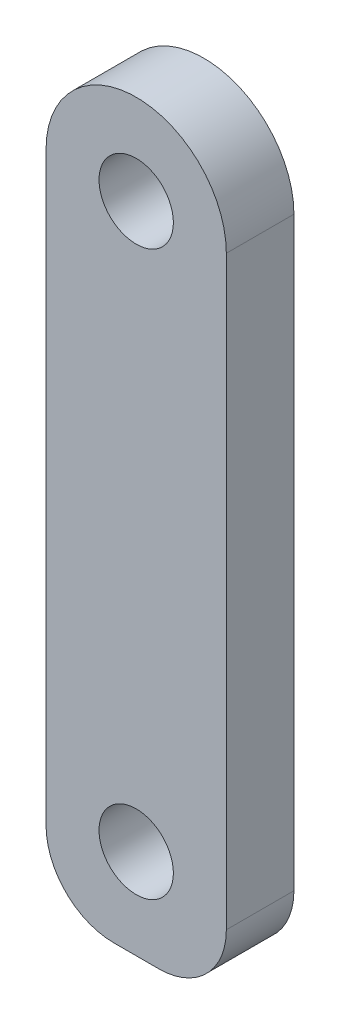
ISO-10303-21;
HEADER;
FILE_DESCRIPTION(('STEP AP214'),'2;1');
FILE_NAME('part.step','',(''),(''),'','','');
FILE_SCHEMA(('AUTOMOTIVE_DESIGN { 1 0 10303 214 1 1 1 1 }'));
ENDSEC;
DATA;
#1=APPLICATION_CONTEXT('core data for automotive mechanical design processes');
#2=APPLICATION_PROTOCOL_DEFINITION('international standard','automotive_design',2000,#1);
#3=PRODUCT_CONTEXT('',#1,'mechanical');
#4=PRODUCT('Part','Part','',(#3));
#5=PRODUCT_RELATED_PRODUCT_CATEGORY('part','',(#4));
#6=PRODUCT_DEFINITION_FORMATION('','',#4);
#7=PRODUCT_DEFINITION_CONTEXT('part definition',#1,'design');
#8=PRODUCT_DEFINITION('design','',#6,#7);
#9=PRODUCT_DEFINITION_SHAPE('','',#8);
#10=(LENGTH_UNIT() NAMED_UNIT(*) SI_UNIT(.MILLI.,.METRE.));
#11=(NAMED_UNIT(*) PLANE_ANGLE_UNIT() SI_UNIT($,.RADIAN.));
#12=(NAMED_UNIT(*) SI_UNIT($,.STERADIAN.) SOLID_ANGLE_UNIT());
#13=UNCERTAINTY_MEASURE_WITH_UNIT(LENGTH_MEASURE(1.E-05),#10,'distance_accuracy_value','');
#14=(GEOMETRIC_REPRESENTATION_CONTEXT(3) GLOBAL_UNCERTAINTY_ASSIGNED_CONTEXT((#13)) GLOBAL_UNIT_ASSIGNED_CONTEXT((#10,
#11,#12)) REPRESENTATION_CONTEXT('',''));
#15=CARTESIAN_POINT('',(0.,0.,0.));
#16=DIRECTION('',(0.,0.,1.));
#17=DIRECTION('',(1.,0.,0.));
#18=AXIS2_PLACEMENT_3D('',#15,#16,#17);
#19=CARTESIAN_POINT('',(0.,12.5,0.));
#20=DIRECTION('',(0.,0.,-1.));
#21=DIRECTION('',(-1.,0.,0.));
#22=AXIS2_PLACEMENT_3D('',#19,#20,#21);
#23=CYLINDRICAL_SURFACE('',#22,4.);
#24=DIRECTION('',(0.,0.,-1.));
#25=VECTOR('',#24,1.);
#26=CARTESIAN_POINT('',(4.,12.5,3.));
#27=LINE('',#26,#25);
#28=CARTESIAN_POINT('',(4.,12.5,0.));
#29=VERTEX_POINT('',#28);
#30=CARTESIAN_POINT('',(4.,12.5,3.));
#31=VERTEX_POINT('',#30);
#32=EDGE_CURVE('E100',#29,#31,#27,.F.);
#33=ORIENTED_EDGE('',*,*,#32,.F.);
#34=CARTESIAN_POINT('',(0.,12.5,0.));
#35=DIRECTION('',(0.,0.,1.));
#36=DIRECTION('',(1.,0.,0.));
#37=AXIS2_PLACEMENT_3D('',#34,#35,#36);
#38=CIRCLE('',#37,4.);
#39=CARTESIAN_POINT('',(-4.,12.5,0.));
#40=VERTEX_POINT('',#39);
#41=EDGE_CURVE('E43',#40,#29,#38,.F.);
#42=ORIENTED_EDGE('',*,*,#41,.F.);
#43=DIRECTION('',(0.,0.,-1.));
#44=VECTOR('',#43,1.);
#45=CARTESIAN_POINT('',(-4.,12.5,3.));
#46=LINE('',#45,#44);
#47=CARTESIAN_POINT('',(-4.,12.5,3.));
#48=VERTEX_POINT('',#47);
#49=EDGE_CURVE('E133',#48,#40,#46,.T.);
#50=ORIENTED_EDGE('',*,*,#49,.F.);
#51=CARTESIAN_POINT('',(0.,12.5,3.));
#52=DIRECTION('',(0.,0.,1.));
#53=DIRECTION('',(1.,0.,0.));
#54=AXIS2_PLACEMENT_3D('',#51,#52,#53);
#55=CIRCLE('',#54,4.);
#56=EDGE_CURVE('E11',#31,#48,#55,.T.);
#57=ORIENTED_EDGE('',*,*,#56,.F.);
#58=EDGE_LOOP('',(#33,#42,#50,#57));
#59=FACE_BOUND('',#58,.T.);
#60=ADVANCED_FACE('F35',(#59),#23,.T.);
#61=CARTESIAN_POINT('',(-1.,-13.5,3.));
#62=DIRECTION('',(0.,0.,1.));
#63=DIRECTION('',(1.,0.,0.));
#64=AXIS2_PLACEMENT_3D('',#61,#62,#63);
#65=PLANE('',#64);
#66=CARTESIAN_POINT('',(0.,12.5,3.));
#67=DIRECTION('',(0.,0.,1.));
#68=DIRECTION('',(1.,0.,0.));
#69=AXIS2_PLACEMENT_3D('',#66,#67,#68);
#70=CIRCLE('',#69,1.65);
#71=CARTESIAN_POINT('',(1.65,12.5,3.));
#72=VERTEX_POINT('',#71);
#73=EDGE_CURVE('E117',#72,#72,#70,.T.);
#74=ORIENTED_EDGE('',*,*,#73,.F.);
#75=EDGE_LOOP('',(#74));
#76=FACE_BOUND('',#75,.T.);
#77=DIRECTION('',(0.,1.,0.));
#78=VECTOR('',#77,1.);
#79=CARTESIAN_POINT('',(4.,-13.5,3.));
#80=LINE('',#79,#78);
#81=CARTESIAN_POINT('',(4.,-13.5,3.));
#82=VERTEX_POINT('',#81);
#83=EDGE_CURVE('E91',#82,#31,#80,.T.);
#84=ORIENTED_EDGE('',*,*,#83,.T.);
#85=ORIENTED_EDGE('',*,*,#56,.T.);
#86=DIRECTION('',(0.,-1.,0.));
#87=VECTOR('',#86,1.);
#88=CARTESIAN_POINT('',(-4.,-13.5,3.));
#89=LINE('',#88,#87);
#90=CARTESIAN_POINT('',(-4.,-13.5,3.));
#91=VERTEX_POINT('',#90);
#92=EDGE_CURVE('E83',#48,#91,#89,.T.);
#93=ORIENTED_EDGE('',*,*,#92,.T.);
#94=CARTESIAN_POINT('',(-1.,-13.5,3.));
#95=DIRECTION('',(0.,0.,1.));
#96=DIRECTION('',(1.,0.,0.));
#97=AXIS2_PLACEMENT_3D('',#94,#95,#96);
#98=CIRCLE('',#97,3.);
#99=CARTESIAN_POINT('',(-0.99999999999998,-16.5,3.));
#100=VERTEX_POINT('',#99);
#101=EDGE_CURVE('E88',#91,#100,#98,.T.);
#102=ORIENTED_EDGE('',*,*,#101,.T.);
#103=DIRECTION('',(1.,0.,0.));
#104=VECTOR('',#103,1.);
#105=CARTESIAN_POINT('',(-0.999999999999979,-16.5,3.));
#106=LINE('',#105,#104);
#107=CARTESIAN_POINT('',(0.999999999999979,-16.5,3.));
#108=VERTEX_POINT('',#107);
#109=EDGE_CURVE('E106',#100,#108,#106,.T.);
#110=ORIENTED_EDGE('',*,*,#109,.T.);
#111=CARTESIAN_POINT('',(1.,-13.5,3.));
#112=DIRECTION('',(0.,0.,1.));
#113=DIRECTION('',(-1.,0.,0.));
#114=AXIS2_PLACEMENT_3D('',#111,#112,#113);
#115=CIRCLE('',#114,3.);
#116=EDGE_CURVE('E108',#108,#82,#115,.T.);
#117=ORIENTED_EDGE('',*,*,#116,.T.);
#118=EDGE_LOOP('',(#84,#85,#93,#102,#110,#117));
#119=FACE_BOUND('',#118,.T.);
#120=CARTESIAN_POINT('',(0.,-12.5,3.));
#121=DIRECTION('',(0.,0.,1.));
#122=DIRECTION('',(1.,0.,0.));
#123=AXIS2_PLACEMENT_3D('',#120,#121,#122);
#124=CIRCLE('',#123,1.65);
#125=CARTESIAN_POINT('',(1.65,-12.5,3.));
#126=VERTEX_POINT('',#125);
#127=EDGE_CURVE('E154',#126,#126,#124,.T.);
#128=ORIENTED_EDGE('',*,*,#127,.F.);
#129=EDGE_LOOP('',(#128));
#130=FACE_BOUND('',#129,.T.);
#131=ADVANCED_FACE('F85',(#76,#119,#130),#65,.T.);
#132=CARTESIAN_POINT('',(-1.,-13.5,0.));
#133=DIRECTION('',(0.,0.,1.));
#134=DIRECTION('',(1.,0.,0.));
#135=AXIS2_PLACEMENT_3D('',#132,#133,#134);
#136=PLANE('',#135);
#137=DIRECTION('',(0.,-1.,0.));
#138=VECTOR('',#137,1.);
#139=CARTESIAN_POINT('',(-4.,-13.5,0.));
#140=LINE('',#139,#138);
#141=CARTESIAN_POINT('',(-4.,-13.5,0.));
#142=VERTEX_POINT('',#141);
#143=EDGE_CURVE('E97',#40,#142,#140,.T.);
#144=ORIENTED_EDGE('',*,*,#143,.F.);
#145=ORIENTED_EDGE('',*,*,#41,.T.);
#146=DIRECTION('',(0.,1.,0.));
#147=VECTOR('',#146,1.);
#148=CARTESIAN_POINT('',(4.,-13.5,0.));
#149=LINE('',#148,#147);
#150=CARTESIAN_POINT('',(4.,-13.5,0.));
#151=VERTEX_POINT('',#150);
#152=EDGE_CURVE('E114',#151,#29,#149,.T.);
#153=ORIENTED_EDGE('',*,*,#152,.F.);
#154=CARTESIAN_POINT('',(1.,-13.5,0.));
#155=DIRECTION('',(0.,0.,1.));
#156=DIRECTION('',(-1.,0.,0.));
#157=AXIS2_PLACEMENT_3D('',#154,#155,#156);
#158=CIRCLE('',#157,3.);
#159=CARTESIAN_POINT('',(0.999999999999979,-16.5,0.));
#160=VERTEX_POINT('',#159);
#161=EDGE_CURVE('E123',#160,#151,#158,.T.);
#162=ORIENTED_EDGE('',*,*,#161,.F.);
#163=DIRECTION('',(1.,0.,0.));
#164=VECTOR('',#163,1.);
#165=CARTESIAN_POINT('',(-0.999999999999979,-16.5,0.));
#166=LINE('',#165,#164);
#167=CARTESIAN_POINT('',(-0.99999999999998,-16.5,0.));
#168=VERTEX_POINT('',#167);
#169=EDGE_CURVE('E121',#168,#160,#166,.T.);
#170=ORIENTED_EDGE('',*,*,#169,.F.);
#171=CARTESIAN_POINT('',(-1.,-13.5,0.));
#172=DIRECTION('',(0.,0.,1.));
#173=DIRECTION('',(1.,0.,0.));
#174=AXIS2_PLACEMENT_3D('',#171,#172,#173);
#175=CIRCLE('',#174,3.);
#176=EDGE_CURVE('E119',#142,#168,#175,.T.);
#177=ORIENTED_EDGE('',*,*,#176,.F.);
#178=EDGE_LOOP('',(#144,#145,#153,#162,#170,#177));
#179=FACE_BOUND('',#178,.T.);
#180=CARTESIAN_POINT('',(0.,12.5,0.));
#181=DIRECTION('',(0.,0.,1.));
#182=DIRECTION('',(1.,0.,0.));
#183=AXIS2_PLACEMENT_3D('',#180,#181,#182);
#184=CIRCLE('',#183,1.65);
#185=CARTESIAN_POINT('',(1.65,12.5,0.));
#186=VERTEX_POINT('',#185);
#187=EDGE_CURVE('E151',#186,#186,#184,.T.);
#188=ORIENTED_EDGE('',*,*,#187,.T.);
#189=EDGE_LOOP('',(#188));
#190=FACE_BOUND('',#189,.T.);
#191=CARTESIAN_POINT('',(0.,-12.5,0.));
#192=DIRECTION('',(0.,0.,1.));
#193=DIRECTION('',(1.,0.,0.));
#194=AXIS2_PLACEMENT_3D('',#191,#192,#193);
#195=CIRCLE('',#194,1.65);
#196=CARTESIAN_POINT('',(1.65,-12.5,0.));
#197=VERTEX_POINT('',#196);
#198=EDGE_CURVE('E157',#197,#197,#195,.T.);
#199=ORIENTED_EDGE('',*,*,#198,.T.);
#200=EDGE_LOOP('',(#199));
#201=FACE_BOUND('',#200,.T.);
#202=ADVANCED_FACE('F136',(#179,#190,#201),#136,.F.);
#203=CARTESIAN_POINT('',(4.,-13.5,3.));
#204=DIRECTION('',(-1.,0.,0.));
#205=DIRECTION('',(0.,0.,1.));
#206=AXIS2_PLACEMENT_3D('',#203,#204,#205);
#207=PLANE('',#206);
#208=ORIENTED_EDGE('',*,*,#152,.T.);
#209=ORIENTED_EDGE('',*,*,#32,.T.);
#210=ORIENTED_EDGE('',*,*,#83,.F.);
#211=DIRECTION('',(0.,0.,-1.));
#212=VECTOR('',#211,1.);
#213=CARTESIAN_POINT('',(4.,-13.5,3.));
#214=LINE('',#213,#212);
#215=EDGE_CURVE('E113',#82,#151,#214,.T.);
#216=ORIENTED_EDGE('',*,*,#215,.T.);
#217=EDGE_LOOP('',(#208,#209,#210,#216));
#218=FACE_BOUND('',#217,.T.);
#219=ADVANCED_FACE('F141',(#218),#207,.F.);
#220=CARTESIAN_POINT('',(-4.,-13.5,3.));
#221=DIRECTION('',(1.,0.,0.));
#222=DIRECTION('',(0.,0.,-1.));
#223=AXIS2_PLACEMENT_3D('',#220,#221,#222);
#224=PLANE('',#223);
#225=ORIENTED_EDGE('',*,*,#92,.F.);
#226=ORIENTED_EDGE('',*,*,#49,.T.);
#227=ORIENTED_EDGE('',*,*,#143,.T.);
#228=DIRECTION('',(0.,0.,-1.));
#229=VECTOR('',#228,1.);
#230=CARTESIAN_POINT('',(-4.,-13.5,3.));
#231=LINE('',#230,#229);
#232=EDGE_CURVE('E94',#91,#142,#231,.T.);
#233=ORIENTED_EDGE('',*,*,#232,.F.);
#234=EDGE_LOOP('',(#225,#226,#227,#233));
#235=FACE_BOUND('',#234,.T.);
#236=ADVANCED_FACE('F95',(#235),#224,.F.);
#237=CARTESIAN_POINT('',(-1.,-13.5,3.));
#238=DIRECTION('',(0.,0.,-1.));
#239=DIRECTION('',(-1.,0.,0.));
#240=AXIS2_PLACEMENT_3D('',#237,#238,#239);
#241=CYLINDRICAL_SURFACE('',#240,3.);
#242=ORIENTED_EDGE('',*,*,#176,.T.);
#243=DIRECTION('',(0.,0.,-1.));
#244=VECTOR('',#243,1.);
#245=CARTESIAN_POINT('',(-0.99999999999998,-16.5,3.));
#246=LINE('',#245,#244);
#247=EDGE_CURVE('E101',#100,#168,#246,.T.);
#248=ORIENTED_EDGE('',*,*,#247,.F.);
#249=ORIENTED_EDGE('',*,*,#101,.F.);
#250=ORIENTED_EDGE('',*,*,#232,.T.);
#251=EDGE_LOOP('',(#242,#248,#249,#250));
#252=FACE_BOUND('',#251,.T.);
#253=ADVANCED_FACE('F103',(#252),#241,.T.);
#254=CARTESIAN_POINT('',(-0.999999999999979,-16.5,3.));
#255=DIRECTION('',(0.,1.,0.));
#256=DIRECTION('',(0.,0.,1.));
#257=AXIS2_PLACEMENT_3D('',#254,#255,#256);
#258=PLANE('',#257);
#259=ORIENTED_EDGE('',*,*,#169,.T.);
#260=DIRECTION('',(0.,0.,-1.));
#261=VECTOR('',#260,1.);
#262=CARTESIAN_POINT('',(0.999999999999979,-16.5,3.));
#263=LINE('',#262,#261);
#264=EDGE_CURVE('E127',#108,#160,#263,.T.);
#265=ORIENTED_EDGE('',*,*,#264,.F.);
#266=ORIENTED_EDGE('',*,*,#109,.F.);
#267=ORIENTED_EDGE('',*,*,#247,.T.);
#268=EDGE_LOOP('',(#259,#265,#266,#267));
#269=FACE_BOUND('',#268,.T.);
#270=ADVANCED_FACE('F149',(#269),#258,.F.);
#271=CARTESIAN_POINT('',(1.,-13.5,3.));
#272=DIRECTION('',(0.,0.,-1.));
#273=DIRECTION('',(-1.,0.,0.));
#274=AXIS2_PLACEMENT_3D('',#271,#272,#273);
#275=CYLINDRICAL_SURFACE('',#274,3.);
#276=ORIENTED_EDGE('',*,*,#161,.T.);
#277=ORIENTED_EDGE('',*,*,#215,.F.);
#278=ORIENTED_EDGE('',*,*,#116,.F.);
#279=ORIENTED_EDGE('',*,*,#264,.T.);
#280=EDGE_LOOP('',(#276,#277,#278,#279));
#281=FACE_BOUND('',#280,.T.);
#282=ADVANCED_FACE('F145',(#281),#275,.T.);
#283=CARTESIAN_POINT('',(0.,12.5,3.));
#284=DIRECTION('',(0.,0.,-1.));
#285=DIRECTION('',(-1.,0.,0.));
#286=AXIS2_PLACEMENT_3D('',#283,#284,#285);
#287=CYLINDRICAL_SURFACE('',#286,1.65);
#288=ORIENTED_EDGE('',*,*,#73,.T.);
#289=EDGE_LOOP('',(#288));
#290=FACE_BOUND('',#289,.T.);
#291=ORIENTED_EDGE('',*,*,#187,.F.);
#292=EDGE_LOOP('',(#291));
#293=FACE_BOUND('',#292,.T.);
#294=ADVANCED_FACE('F175',(#290,#293),#287,.F.);
#295=CARTESIAN_POINT('',(0.,-12.5,3.));
#296=DIRECTION('',(0.,0.,-1.));
#297=DIRECTION('',(-1.,0.,0.));
#298=AXIS2_PLACEMENT_3D('',#295,#296,#297);
#299=CYLINDRICAL_SURFACE('',#298,1.65);
#300=ORIENTED_EDGE('',*,*,#127,.T.);
#301=EDGE_LOOP('',(#300));
#302=FACE_BOUND('',#301,.T.);
#303=ORIENTED_EDGE('',*,*,#198,.F.);
#304=EDGE_LOOP('',(#303));
#305=FACE_BOUND('',#304,.T.);
#306=ADVANCED_FACE('F163',(#302,#305),#299,.F.);
#307=CLOSED_SHELL('',(#60,#131,#202,#219,#236,#253,#270,#282,#294,#306));
#308=MANIFOLD_SOLID_BREP('B2',#307);
#309=ADVANCED_BREP_SHAPE_REPRESENTATION('',(#18,#308),#14);
#310=SHAPE_DEFINITION_REPRESENTATION(#9,#309);
ENDSEC;
END-ISO-10303-21;
